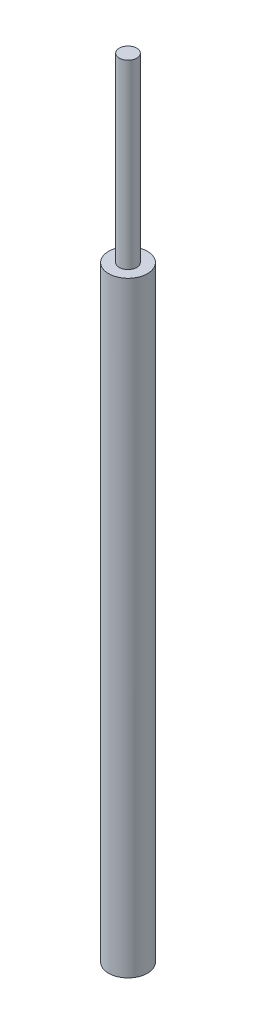
ISO-10303-21;
HEADER;
FILE_DESCRIPTION(('STEP AP214'),'2;1');
FILE_NAME('part.step','',(''),(''),'','','');
FILE_SCHEMA(('AUTOMOTIVE_DESIGN { 1 0 10303 214 1 1 1 1 }'));
ENDSEC;
DATA;
#1=APPLICATION_CONTEXT('core data for automotive mechanical design processes');
#2=APPLICATION_PROTOCOL_DEFINITION('international standard','automotive_design',2000,#1);
#3=PRODUCT_CONTEXT('',#1,'mechanical');
#4=PRODUCT('Part','Part','',(#3));
#5=PRODUCT_RELATED_PRODUCT_CATEGORY('part','',(#4));
#6=PRODUCT_DEFINITION_FORMATION('','',#4);
#7=PRODUCT_DEFINITION_CONTEXT('part definition',#1,'design');
#8=PRODUCT_DEFINITION('design','',#6,#7);
#9=PRODUCT_DEFINITION_SHAPE('','',#8);
#10=(LENGTH_UNIT() NAMED_UNIT(*) SI_UNIT(.MILLI.,.METRE.));
#11=(NAMED_UNIT(*) PLANE_ANGLE_UNIT() SI_UNIT($,.RADIAN.));
#12=(NAMED_UNIT(*) SI_UNIT($,.STERADIAN.) SOLID_ANGLE_UNIT());
#13=UNCERTAINTY_MEASURE_WITH_UNIT(LENGTH_MEASURE(1.E-05),#10,'distance_accuracy_value','');
#14=(GEOMETRIC_REPRESENTATION_CONTEXT(3) GLOBAL_UNCERTAINTY_ASSIGNED_CONTEXT((#13)) GLOBAL_UNIT_ASSIGNED_CONTEXT((#10,
#11,#12)) REPRESENTATION_CONTEXT('',''));
#15=CARTESIAN_POINT('',(0.,0.,0.));
#16=DIRECTION('',(0.,0.,1.));
#17=DIRECTION('',(1.,0.,0.));
#18=AXIS2_PLACEMENT_3D('',#15,#16,#17);
#19=CARTESIAN_POINT('',(-17.9578,-3.3782,-0.5588));
#20=DIRECTION('',(0.,1.,0.));
#21=DIRECTION('',(1.,0.,0.));
#22=AXIS2_PLACEMENT_3D('',#19,#20,#21);
#23=PLANE('',#22);
#24=CARTESIAN_POINT('',(-17.9578,-3.3782,-0.5588));
#25=DIRECTION('',(0.,1.,0.));
#26=DIRECTION('',(-0.531068091087651,0.,-0.84732914657087));
#27=AXIS2_PLACEMENT_3D('',#24,#25,#26);
#28=CIRCLE('',#27,0.2286);
#29=CARTESIAN_POINT('',(-17.8363978343773,-3.3782,-0.365100557093899));
#30=VERTEX_POINT('',#29);
#31=EDGE_CURVE('E54',#30,#30,#28,.T.);
#32=ORIENTED_EDGE('',*,*,#31,.T.);
#33=EDGE_LOOP('',(#32));
#34=FACE_BOUND('',#33,.T.);
#35=ADVANCED_FACE('F17',(#34),#23,.T.);
#36=CARTESIAN_POINT('',(-17.9578,-24.003,-0.5588));
#37=DIRECTION('',(0.,1.,0.));
#38=DIRECTION('',(1.,0.,0.));
#39=AXIS2_PLACEMENT_3D('',#36,#37,#38);
#40=PLANE('',#39);
#41=CARTESIAN_POINT('',(-17.9578,-24.003,-0.5588));
#42=DIRECTION('',(0.,1.,0.));
#43=DIRECTION('',(-0.531068091087654,0.,-0.847329146570868));
#44=AXIS2_PLACEMENT_3D('',#41,#42,#43);
#45=CIRCLE('',#44,0.508);
#46=CARTESIAN_POINT('',(-17.6880174097275,-24.003,-0.128356793542));
#47=VERTEX_POINT('',#46);
#48=EDGE_CURVE('E28',#47,#47,#45,.T.);
#49=ORIENTED_EDGE('',*,*,#48,.F.);
#50=EDGE_LOOP('',(#49));
#51=FACE_BOUND('',#50,.T.);
#52=ADVANCED_FACE('F76',(#51),#40,.F.);
#53=CARTESIAN_POINT('',(-17.9578,-8.128,-0.5588));
#54=DIRECTION('',(0.,1.,0.));
#55=DIRECTION('',(1.,0.,0.));
#56=AXIS2_PLACEMENT_3D('',#53,#54,#55);
#57=PLANE('',#56);
#58=CARTESIAN_POINT('',(-17.9578,-8.128,-0.5588));
#59=DIRECTION('',(0.,1.,0.));
#60=DIRECTION('',(-0.531068091087651,0.,-0.84732914657087));
#61=AXIS2_PLACEMENT_3D('',#58,#59,#60);
#62=CIRCLE('',#61,0.2286);
#63=CARTESIAN_POINT('',(-17.8363978343773,-8.128,-0.365100557093899));
#64=VERTEX_POINT('',#63);
#65=EDGE_CURVE('E21',#64,#64,#62,.T.);
#66=ORIENTED_EDGE('',*,*,#65,.F.);
#67=EDGE_LOOP('',(#66));
#68=FACE_BOUND('',#67,.T.);
#69=CARTESIAN_POINT('',(-17.9578,-8.128,-0.5588));
#70=DIRECTION('',(0.,1.,0.));
#71=DIRECTION('',(-0.531068091087654,0.,-0.847329146570868));
#72=AXIS2_PLACEMENT_3D('',#69,#70,#71);
#73=CIRCLE('',#72,0.508);
#74=CARTESIAN_POINT('',(-18.2275825902725,-8.128,-0.989243206458002));
#75=VERTEX_POINT('',#74);
#76=EDGE_CURVE('E11',#75,#75,#73,.T.);
#77=ORIENTED_EDGE('',*,*,#76,.T.);
#78=EDGE_LOOP('',(#77));
#79=FACE_BOUND('',#78,.T.);
#80=ADVANCED_FACE('F19',(#68,#79),#57,.T.);
#81=CARTESIAN_POINT('',(-17.9578,-24.003,-0.5588));
#82=DIRECTION('',(0.,1.,0.));
#83=DIRECTION('',(-0.531068091087654,0.,-0.847329146570868));
#84=AXIS2_PLACEMENT_3D('',#81,#82,#83);
#85=CYLINDRICAL_SURFACE('',#84,0.508);
#86=ORIENTED_EDGE('',*,*,#76,.F.);
#87=EDGE_LOOP('',(#86));
#88=FACE_BOUND('',#87,.T.);
#89=ORIENTED_EDGE('',*,*,#48,.T.);
#90=EDGE_LOOP('',(#89));
#91=FACE_BOUND('',#90,.T.);
#92=ADVANCED_FACE('F67',(#88,#91),#85,.T.);
#93=CARTESIAN_POINT('',(-17.9578,-3.3782,-0.5588));
#94=DIRECTION('',(0.,-1.,0.));
#95=DIRECTION('',(0.531068091087651,0.,0.84732914657087));
#96=AXIS2_PLACEMENT_3D('',#93,#94,#95);
#97=CYLINDRICAL_SURFACE('',#96,0.2286);
#98=ORIENTED_EDGE('',*,*,#65,.T.);
#99=EDGE_LOOP('',(#98));
#100=FACE_BOUND('',#99,.T.);
#101=ORIENTED_EDGE('',*,*,#31,.F.);
#102=EDGE_LOOP('',(#101));
#103=FACE_BOUND('',#102,.T.);
#104=ADVANCED_FACE('F50',(#100,#103),#97,.T.);
#105=CLOSED_SHELL('',(#35,#52,#80,#92,#104));
#106=MANIFOLD_SOLID_BREP('B1',#105);
#107=ADVANCED_BREP_SHAPE_REPRESENTATION('',(#18,#106),#14);
#108=SHAPE_DEFINITION_REPRESENTATION(#9,#107);
ENDSEC;
END-ISO-10303-21;
